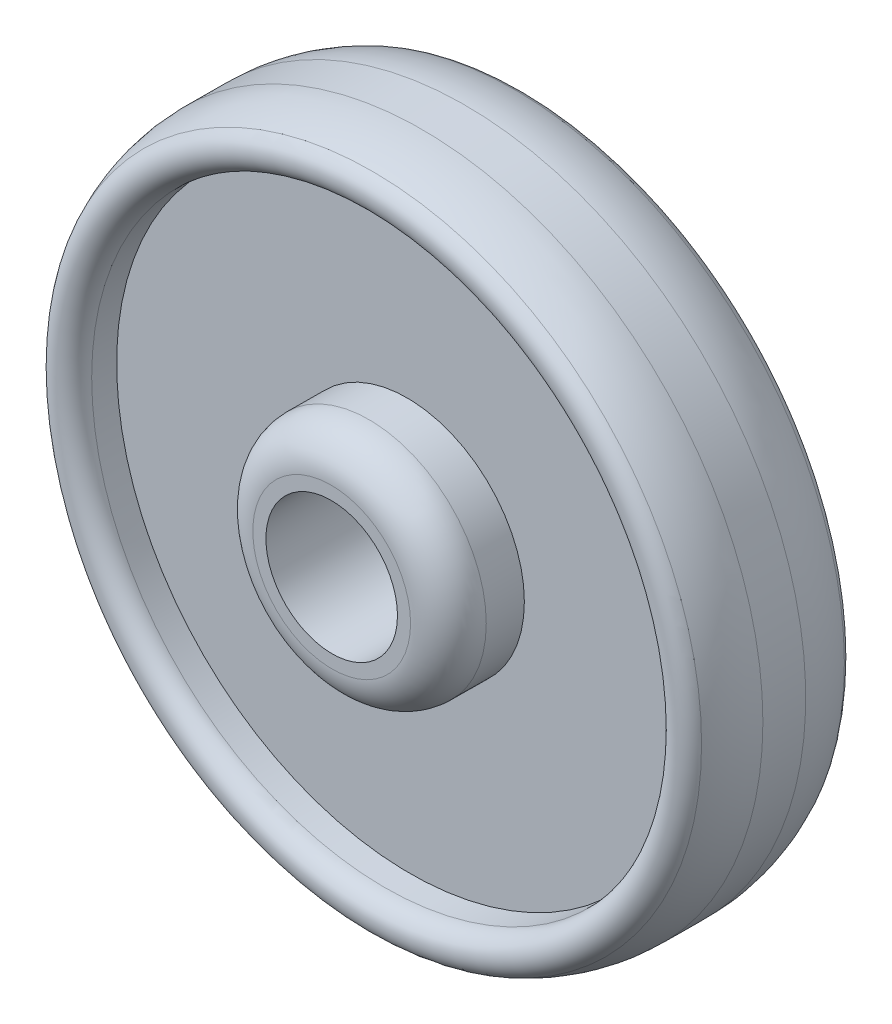
ISO-10303-21;
HEADER;
FILE_DESCRIPTION(('STEP AP214'),'2;1');
FILE_NAME('part.step','',(''),(''),'','','');
FILE_SCHEMA(('AUTOMOTIVE_DESIGN { 1 0 10303 214 1 1 1 1 }'));
ENDSEC;
DATA;
#1=APPLICATION_CONTEXT('core data for automotive mechanical design processes');
#2=APPLICATION_PROTOCOL_DEFINITION('international standard','automotive_design',2000,#1);
#3=PRODUCT_CONTEXT('',#1,'mechanical');
#4=PRODUCT('Part','Part','',(#3));
#5=PRODUCT_RELATED_PRODUCT_CATEGORY('part','',(#4));
#6=PRODUCT_DEFINITION_FORMATION('','',#4);
#7=PRODUCT_DEFINITION_CONTEXT('part definition',#1,'design');
#8=PRODUCT_DEFINITION('design','',#6,#7);
#9=PRODUCT_DEFINITION_SHAPE('','',#8);
#10=(LENGTH_UNIT() NAMED_UNIT(*) SI_UNIT(.MILLI.,.METRE.));
#11=(NAMED_UNIT(*) PLANE_ANGLE_UNIT() SI_UNIT($,.RADIAN.));
#12=(NAMED_UNIT(*) SI_UNIT($,.STERADIAN.) SOLID_ANGLE_UNIT());
#13=UNCERTAINTY_MEASURE_WITH_UNIT(LENGTH_MEASURE(1.E-05),#10,'distance_accuracy_value','');
#14=(GEOMETRIC_REPRESENTATION_CONTEXT(3) GLOBAL_UNCERTAINTY_ASSIGNED_CONTEXT((#13)) GLOBAL_UNIT_ASSIGNED_CONTEXT((#10,
#11,#12)) REPRESENTATION_CONTEXT('',''));
#15=CARTESIAN_POINT('',(0.,0.,0.));
#16=DIRECTION('',(0.,0.,1.));
#17=DIRECTION('',(1.,0.,0.));
#18=AXIS2_PLACEMENT_3D('',#15,#16,#17);
#19=CARTESIAN_POINT('',(-31.5622900748722,26.7347311363403,8.81985132786662));
#20=DIRECTION('',(-0.00675871027734653,0.,0.999977159656853));
#21=DIRECTION('',(0.999977159656853,0.,0.00675871027734653));
#22=AXIS2_PLACEMENT_3D('',#19,#20,#21);
#23=PLANE('',#22);
#24=CARTESIAN_POINT('',(-31.5622900748722,26.7347311363403,8.81985132786662));
#25=DIRECTION('',(-0.00675871027734653,0.,0.999977159656853));
#26=DIRECTION('',(0.999977159656853,0.,0.00675871027734653));
#27=AXIS2_PLACEMENT_3D('',#24,#25,#26);
#28=CIRCLE('',#27,2.09851706206891);
#29=CARTESIAN_POINT('',(-29.4638209436531,26.7347311363403,8.83403459670121));
#30=VERTEX_POINT('',#29);
#31=EDGE_CURVE('E76',#30,#30,#28,.F.);
#32=ORIENTED_EDGE('',*,*,#31,.T.);
#33=EDGE_LOOP('',(#32));
#34=FACE_BOUND('',#33,.T.);
#35=CARTESIAN_POINT('',(-31.5622900748722,26.7347311363403,8.81985132786662));
#36=DIRECTION('',(-0.00675871027734653,0.,0.999977159656853));
#37=DIRECTION('',(0.999977159656853,0.,0.00675871027734653));
#38=AXIS2_PLACEMENT_3D('',#35,#36,#37);
#39=CIRCLE('',#38,1.75);
#40=CARTESIAN_POINT('',(-29.8123300454727,26.7347311363403,8.83167907085197));
#41=VERTEX_POINT('',#40);
#42=EDGE_CURVE('E88',#41,#41,#39,.T.);
#43=ORIENTED_EDGE('',*,*,#42,.T.);
#44=EDGE_LOOP('',(#43));
#45=FACE_BOUND('',#44,.T.);
#46=ADVANCED_FACE('F38',(#34,#45),#23,.F.);
#47=CARTESIAN_POINT('',(-31.6028423365363,26.7347311363403,14.8197142858077));
#48=DIRECTION('',(-0.00675871027734653,0.,0.999977159656853));
#49=DIRECTION('',(0.999977159656853,0.,0.00675871027734653));
#50=AXIS2_PLACEMENT_3D('',#47,#48,#49);
#51=PLANE('',#50);
#52=CARTESIAN_POINT('',(-31.6028423365363,26.7347311363403,14.8197142858077));
#53=DIRECTION('',(-0.00675871027734653,0.,0.999977159656853));
#54=DIRECTION('',(0.999977159656853,0.,0.00675871027734653));
#55=AXIS2_PLACEMENT_3D('',#52,#53,#54);
#56=CIRCLE('',#55,2.09851706206892);
#57=CARTESIAN_POINT('',(-29.5043732053172,26.7347311363403,14.8338975546423));
#58=VERTEX_POINT('',#57);
#59=EDGE_CURVE('E68',#58,#58,#56,.T.);
#60=ORIENTED_EDGE('',*,*,#59,.T.);
#61=EDGE_LOOP('',(#60));
#62=FACE_BOUND('',#61,.T.);
#63=CARTESIAN_POINT('',(-31.6028423365363,26.7347311363403,14.8197142858077));
#64=DIRECTION('',(-0.00675871027734653,0.,0.999977159656853));
#65=DIRECTION('',(0.999977159656853,0.,0.00675871027734653));
#66=AXIS2_PLACEMENT_3D('',#63,#64,#65);
#67=CIRCLE('',#66,1.75);
#68=CARTESIAN_POINT('',(-29.8528823071368,26.7347311363403,14.8315420287931));
#69=VERTEX_POINT('',#68);
#70=EDGE_CURVE('E87',#69,#69,#67,.T.);
#71=ORIENTED_EDGE('',*,*,#70,.F.);
#72=EDGE_LOOP('',(#71));
#73=FACE_BOUND('',#72,.T.);
#74=ADVANCED_FACE('F131',(#62,#73),#51,.T.);
#75=CARTESIAN_POINT('',(-31.6028423365363,26.7347311363403,14.8197142858077));
#76=DIRECTION('',(0.00675871027734653,0.,-0.999977159656853));
#77=DIRECTION('',(-0.999977159656853,0.,-0.00675871027734653));
#78=AXIS2_PLACEMENT_3D('',#75,#76,#77);
#79=CYLINDRICAL_SURFACE('',#78,9.);
#80=CARTESIAN_POINT('',(-31.5863657902371,26.7347311363403,12.3819459405042));
#81=DIRECTION('',(-0.00675871027734653,0.,0.999977159656853));
#82=DIRECTION('',(0.999977159656853,0.,0.00675871027734653));
#83=AXIS2_PLACEMENT_3D('',#80,#81,#82);
#84=CIRCLE('',#83,9.);
#85=CARTESIAN_POINT('',(-22.5865713533254,26.7347311363403,12.4427743330003));
#86=VERTEX_POINT('',#85);
#87=EDGE_CURVE('E80',#86,#86,#84,.F.);
#88=ORIENTED_EDGE('',*,*,#87,.T.);
#89=EDGE_LOOP('',(#88));
#90=FACE_BOUND('',#89,.T.);
#91=CARTESIAN_POINT('',(-31.5787666211714,26.7347311363403,11.2576196731702));
#92=DIRECTION('',(0.00675871027734653,0.,-0.999977159656853));
#93=DIRECTION('',(-0.999977159656853,0.,-0.00675871027734653));
#94=AXIS2_PLACEMENT_3D('',#91,#92,#93);
#95=CIRCLE('',#94,9.);
#96=CARTESIAN_POINT('',(-40.5785610580831,26.7347311363403,11.1967912806741));
#97=VERTEX_POINT('',#96);
#98=EDGE_CURVE('E83',#97,#97,#95,.F.);
#99=ORIENTED_EDGE('',*,*,#98,.T.);
#100=EDGE_LOOP('',(#99));
#101=FACE_BOUND('',#100,.T.);
#102=ADVANCED_FACE('F137',(#90,#101),#79,.T.);
#103=CARTESIAN_POINT('',(-31.6028423365363,26.7347311363403,14.8197142858077));
#104=DIRECTION('',(0.00675871027734653,0.,-0.999977159656853));
#105=DIRECTION('',(-0.999977159656853,0.,-0.00675871027734653));
#106=AXIS2_PLACEMENT_3D('',#103,#104,#105);
#107=CYLINDRICAL_SURFACE('',#106,1.75);
#108=ORIENTED_EDGE('',*,*,#70,.T.);
#109=EDGE_LOOP('',(#108));
#110=FACE_BOUND('',#109,.T.);
#111=ORIENTED_EDGE('',*,*,#42,.F.);
#112=EDGE_LOOP('',(#111));
#113=FACE_BOUND('',#112,.T.);
#114=ADVANCED_FACE('F145',(#110,#113),#107,.F.);
#115=CARTESIAN_POINT('',(-31.5893249159816,26.7347311363403,12.819759966494));
#116=DIRECTION('',(-0.00675871027734653,0.,0.999977159656853));
#117=DIRECTION('',(0.999977159656853,0.,0.00675871027734653));
#118=AXIS2_PLACEMENT_3D('',#115,#116,#117);
#119=CYLINDRICAL_SURFACE('',#118,3.09851706206892);
#120=CARTESIAN_POINT('',(-31.5960836262589,26.7347311363403,13.8197371261509));
#121=DIRECTION('',(-0.00675871027734653,0.,0.999977159656853));
#122=DIRECTION('',(0.999977159656853,0.,0.00675871027734653));
#123=AXIS2_PLACEMENT_3D('',#120,#121,#122);
#124=CIRCLE('',#123,3.09851706206892);
#125=CARTESIAN_POINT('',(-28.497637335383,26.7347311363403,13.8406791052628));
#126=VERTEX_POINT('',#125);
#127=EDGE_CURVE('E64',#126,#126,#124,.F.);
#128=ORIENTED_EDGE('',*,*,#127,.T.);
#129=EDGE_LOOP('',(#128));
#130=FACE_BOUND('',#129,.T.);
#131=CARTESIAN_POINT('',(-31.5893249159816,26.7347311363403,12.819759966494));
#132=DIRECTION('',(-0.00675871027734652,0.,0.999977159656853));
#133=DIRECTION('',(0.999977159656853,0.,0.00675871027734652));
#134=AXIS2_PLACEMENT_3D('',#131,#132,#133);
#135=CIRCLE('',#134,3.09851706206892);
#136=CARTESIAN_POINT('',(-28.4908786251056,26.7347311363403,12.840701945606));
#137=VERTEX_POINT('',#136);
#138=EDGE_CURVE('E99',#137,#137,#135,.T.);
#139=ORIENTED_EDGE('',*,*,#138,.T.);
#140=EDGE_LOOP('',(#139));
#141=FACE_BOUND('',#140,.T.);
#142=ADVANCED_FACE('F231',(#130,#141),#119,.T.);
#143=CARTESIAN_POINT('',(-31.5893249159816,26.7347311363403,12.819759966494));
#144=DIRECTION('',(-0.00675871027734653,0.,0.999977159656853));
#145=DIRECTION('',(0.999977159656853,0.,0.00675871027734653));
#146=AXIS2_PLACEMENT_3D('',#143,#144,#145);
#147=CYLINDRICAL_SURFACE('',#146,7.7484318740111);
#148=CARTESIAN_POINT('',(-31.5937527671756,26.7347311363403,13.4748775671457));
#149=DIRECTION('',(0.00675871027734653,0.,-0.999977159656853));
#150=DIRECTION('',(-0.999977159656853,0.,-0.00675871027734653));
#151=AXIS2_PLACEMENT_3D('',#148,#149,#150);
#152=CIRCLE('',#151,7.7484318740111);
#153=CARTESIAN_POINT('',(-39.3420076643439,26.7347311363403,13.4225081610055));
#154=VERTEX_POINT('',#153);
#155=EDGE_CURVE('E46',#154,#154,#152,.F.);
#156=ORIENTED_EDGE('',*,*,#155,.T.);
#157=EDGE_LOOP('',(#156));
#158=FACE_BOUND('',#157,.T.);
#159=CARTESIAN_POINT('',(-31.5893249159816,26.7347311363403,12.819759966494));
#160=DIRECTION('',(-0.00675871027734652,0.,0.999977159656853));
#161=DIRECTION('',(0.999977159656853,0.,0.00675871027734652));
#162=AXIS2_PLACEMENT_3D('',#159,#160,#161);
#163=CIRCLE('',#162,7.7484318740111);
#164=CARTESIAN_POINT('',(-23.8410700188133,26.7347311363403,12.8721293726342));
#165=VERTEX_POINT('',#164);
#166=EDGE_CURVE('E92',#165,#165,#163,.T.);
#167=ORIENTED_EDGE('',*,*,#166,.F.);
#168=EDGE_LOOP('',(#167));
#169=FACE_BOUND('',#168,.T.);
#170=ADVANCED_FACE('F127',(#158,#169),#147,.F.);
#171=CARTESIAN_POINT('',(-0.0880860699983133,0.,13.0326725762285));
#172=DIRECTION('',(-0.00675871027734652,0.,0.999977159656853));
#173=DIRECTION('',(0.999977159656853,0.,0.00675871027734652));
#174=AXIS2_PLACEMENT_3D('',#171,#172,#173);
#175=PLANE('',#174);
#176=ORIENTED_EDGE('',*,*,#138,.F.);
#177=EDGE_LOOP('',(#176));
#178=FACE_BOUND('',#177,.T.);
#179=ORIENTED_EDGE('',*,*,#166,.T.);
#180=EDGE_LOOP('',(#179));
#181=FACE_BOUND('',#180,.T.);
#182=ADVANCED_FACE('F121',(#178,#181),#175,.T.);
#183=CARTESIAN_POINT('',(-31.5758074954269,26.7347311363403,10.8198056471803));
#184=DIRECTION('',(0.00675871027734653,0.,-0.999977159656853));
#185=DIRECTION('',(-0.999977159656853,0.,-0.00675871027734653));
#186=AXIS2_PLACEMENT_3D('',#183,#184,#185);
#187=CYLINDRICAL_SURFACE('',#186,7.74843187401109);
#188=CARTESIAN_POINT('',(-31.5713796442329,26.7347311363403,10.1646880465286));
#189=DIRECTION('',(-0.00675871027734653,0.,0.999977159656853));
#190=DIRECTION('',(0.999977159656853,0.,0.00675871027734653));
#191=AXIS2_PLACEMENT_3D('',#188,#189,#190);
#192=CIRCLE('',#191,7.74843187401109);
#193=CARTESIAN_POINT('',(-23.8231247470646,26.7347311363403,10.2170574526688));
#194=VERTEX_POINT('',#193);
#195=EDGE_CURVE('E58',#194,#194,#192,.F.);
#196=ORIENTED_EDGE('',*,*,#195,.T.);
#197=EDGE_LOOP('',(#196));
#198=FACE_BOUND('',#197,.T.);
#199=CARTESIAN_POINT('',(-31.5758074954269,26.7347311363403,10.8198056471803));
#200=DIRECTION('',(0.00675871027734653,0.,-0.999977159656853));
#201=DIRECTION('',(-0.999977159656853,0.,-0.00675871027734653));
#202=AXIS2_PLACEMENT_3D('',#199,#200,#201);
#203=CIRCLE('',#202,7.74843187401109);
#204=CARTESIAN_POINT('',(-39.3240623925951,26.7347311363403,10.7674362410401));
#205=VERTEX_POINT('',#204);
#206=EDGE_CURVE('E103',#205,#205,#203,.T.);
#207=ORIENTED_EDGE('',*,*,#206,.F.);
#208=EDGE_LOOP('',(#207));
#209=FACE_BOUND('',#208,.T.);
#210=ADVANCED_FACE('F116',(#198,#209),#187,.F.);
#211=CARTESIAN_POINT('',(-31.5758074954269,26.7347311363403,10.8198056471803));
#212=DIRECTION('',(0.00675871027734653,0.,-0.999977159656853));
#213=DIRECTION('',(-0.999977159656853,0.,-0.00675871027734653));
#214=AXIS2_PLACEMENT_3D('',#211,#212,#213);
#215=PLANE('',#214);
#216=CARTESIAN_POINT('',(-31.5758074954269,26.7347311363403,10.8198056471803));
#217=DIRECTION('',(0.00675871027734653,0.,-0.999977159656853));
#218=DIRECTION('',(-0.999977159656853,0.,-0.00675871027734653));
#219=AXIS2_PLACEMENT_3D('',#216,#217,#218);
#220=CIRCLE('',#219,3.09851706206891);
#221=CARTESIAN_POINT('',(-34.6742537863029,26.7347311363403,10.7988636680684));
#222=VERTEX_POINT('',#221);
#223=EDGE_CURVE('E107',#222,#222,#220,.T.);
#224=ORIENTED_EDGE('',*,*,#223,.F.);
#225=EDGE_LOOP('',(#224));
#226=FACE_BOUND('',#225,.T.);
#227=ORIENTED_EDGE('',*,*,#206,.T.);
#228=EDGE_LOOP('',(#227));
#229=FACE_BOUND('',#228,.T.);
#230=ADVANCED_FACE('F113',(#226,#229),#215,.T.);
#231=CARTESIAN_POINT('',(-31.5758074954269,26.7347311363403,10.8198056471803));
#232=DIRECTION('',(0.00675871027734653,0.,-0.999977159656853));
#233=DIRECTION('',(-0.999977159656853,0.,-0.00675871027734653));
#234=AXIS2_PLACEMENT_3D('',#231,#232,#233);
#235=CYLINDRICAL_SURFACE('',#234,3.09851706206891);
#236=CARTESIAN_POINT('',(-31.5690487851496,26.7347311363403,9.81982848752347));
#237=DIRECTION('',(-0.00675871027734653,0.,0.999977159656853));
#238=DIRECTION('',(0.999977159656853,0.,0.00675871027734653));
#239=AXIS2_PLACEMENT_3D('',#236,#237,#238);
#240=CIRCLE('',#239,3.09851706206891);
#241=CARTESIAN_POINT('',(-28.4706024942736,26.7347311363403,9.84077046663541));
#242=VERTEX_POINT('',#241);
#243=EDGE_CURVE('E72',#242,#242,#240,.T.);
#244=ORIENTED_EDGE('',*,*,#243,.T.);
#245=EDGE_LOOP('',(#244));
#246=FACE_BOUND('',#245,.T.);
#247=ORIENTED_EDGE('',*,*,#223,.T.);
#248=EDGE_LOOP('',(#247));
#249=FACE_BOUND('',#248,.T.);
#250=ADVANCED_FACE('F111',(#246,#249),#235,.T.);
#251=CARTESIAN_POINT('',(-31.5863657902371,26.7347311363403,12.3819459405042));
#252=DIRECTION('',(-0.00675871027734653,0.,0.999977159656853));
#253=DIRECTION('',(0.999977159656853,0.,0.00675871027734653));
#254=AXIS2_PLACEMENT_3D('',#251,#252,#253);
#255=TOROIDAL_SURFACE('',#254,6.,3.);
#256=CARTESIAN_POINT('',(-31.5952301625633,26.7347311363403,13.6934638924734));
#257=DIRECTION('',(0.00675871027734653,0.,-0.999977159656853));
#258=DIRECTION('',(-0.999977159656853,0.,-0.00675871027734653));
#259=AXIS2_PLACEMENT_3D('',#256,#257,#258);
#260=CIRCLE('',#259,8.69811824881077);
#261=CARTESIAN_POINT('',(-40.2931497433686,26.7347311363403,13.6346758312716));
#262=VERTEX_POINT('',#261);
#263=EDGE_CURVE('E10',#262,#262,#260,.T.);
#264=ORIENTED_EDGE('',*,*,#263,.T.);
#265=EDGE_LOOP('',(#264));
#266=FACE_BOUND('',#265,.T.);
#267=ORIENTED_EDGE('',*,*,#87,.F.);
#268=EDGE_LOOP('',(#267));
#269=FACE_BOUND('',#268,.T.);
#270=ADVANCED_FACE('F147',(#266,#269),#255,.T.);
#271=CARTESIAN_POINT('',(-31.5787666211714,26.7347311363403,11.2576196731702));
#272=DIRECTION('',(0.00675871027734653,0.,-0.999977159656853));
#273=DIRECTION('',(-0.999977159656853,0.,-0.00675871027734653));
#274=AXIS2_PLACEMENT_3D('',#271,#272,#273);
#275=TOROIDAL_SURFACE('',#274,6.,3.);
#276=CARTESIAN_POINT('',(-31.5699022488452,26.7347311363403,9.94610172120093));
#277=DIRECTION('',(-0.00675871027734653,0.,0.999977159656853));
#278=DIRECTION('',(0.999977159656853,0.,0.00675871027734653));
#279=AXIS2_PLACEMENT_3D('',#276,#277,#278);
#280=CIRCLE('',#279,8.69811824881076);
#281=CARTESIAN_POINT('',(-22.8719826680399,26.7347311363403,10.0048897824027));
#282=VERTEX_POINT('',#281);
#283=EDGE_CURVE('E53',#282,#282,#280,.T.);
#284=ORIENTED_EDGE('',*,*,#283,.T.);
#285=EDGE_LOOP('',(#284));
#286=FACE_BOUND('',#285,.T.);
#287=ORIENTED_EDGE('',*,*,#98,.F.);
#288=EDGE_LOOP('',(#287));
#289=FACE_BOUND('',#288,.T.);
#290=ADVANCED_FACE('F150',(#286,#289),#275,.T.);
#291=CARTESIAN_POINT('',(-31.5690487851496,26.7347311363403,9.81982848752347));
#292=DIRECTION('',(-0.00675871027734653,0.,0.999977159656853));
#293=DIRECTION('',(0.999977159656853,0.,0.00675871027734653));
#294=AXIS2_PLACEMENT_3D('',#291,#292,#293);
#295=TOROIDAL_SURFACE('',#294,2.09851706206891,1.);
#296=ORIENTED_EDGE('',*,*,#243,.F.);
#297=EDGE_LOOP('',(#296));
#298=FACE_BOUND('',#297,.T.);
#299=ORIENTED_EDGE('',*,*,#31,.F.);
#300=EDGE_LOOP('',(#299));
#301=FACE_BOUND('',#300,.T.);
#302=ADVANCED_FACE('F153',(#298,#301),#295,.T.);
#303=CARTESIAN_POINT('',(-31.5960836262589,26.7347311363403,13.8197371261509));
#304=DIRECTION('',(-0.00675871027734653,0.,0.999977159656853));
#305=DIRECTION('',(0.999977159656853,0.,0.00675871027734653));
#306=AXIS2_PLACEMENT_3D('',#303,#304,#305);
#307=TOROIDAL_SURFACE('',#306,2.09851706206892,1.);
#308=ORIENTED_EDGE('',*,*,#127,.F.);
#309=EDGE_LOOP('',(#308));
#310=FACE_BOUND('',#309,.T.);
#311=ORIENTED_EDGE('',*,*,#59,.F.);
#312=EDGE_LOOP('',(#311));
#313=FACE_BOUND('',#312,.T.);
#314=ADVANCED_FACE('F157',(#310,#313),#307,.T.);
#315=CARTESIAN_POINT('',(-31.5713796442329,26.7347311363403,10.1646880465286));
#316=DIRECTION('',(-0.00675871027734653,0.,0.999977159656853));
#317=DIRECTION('',(0.999977159656853,0.,0.00675871027734653));
#318=AXIS2_PLACEMENT_3D('',#315,#316,#317);
#319=TOROIDAL_SURFACE('',#318,8.24843187401003,0.5);
#320=ORIENTED_EDGE('',*,*,#283,.F.);
#321=EDGE_LOOP('',(#320));
#322=FACE_BOUND('',#321,.T.);
#323=ORIENTED_EDGE('',*,*,#195,.F.);
#324=EDGE_LOOP('',(#323));
#325=FACE_BOUND('',#324,.T.);
#326=ADVANCED_FACE('F160',(#322,#325),#319,.T.);
#327=CARTESIAN_POINT('',(-31.5937527671756,26.7347311363403,13.4748775671457));
#328=DIRECTION('',(0.00675871027734653,0.,-0.999977159656853));
#329=DIRECTION('',(-0.999977159656853,0.,-0.00675871027734653));
#330=AXIS2_PLACEMENT_3D('',#327,#328,#329);
#331=TOROIDAL_SURFACE('',#330,8.24843187401003,0.5);
#332=ORIENTED_EDGE('',*,*,#263,.F.);
#333=EDGE_LOOP('',(#332));
#334=FACE_BOUND('',#333,.T.);
#335=ORIENTED_EDGE('',*,*,#155,.F.);
#336=EDGE_LOOP('',(#335));
#337=FACE_BOUND('',#336,.T.);
#338=ADVANCED_FACE('F40',(#334,#337),#331,.T.);
#339=CLOSED_SHELL('',(#46,#74,#102,#114,#142,#170,#182,#210,#230,#250,#270,#290,#302,#314,#326,#338));
#340=MANIFOLD_SOLID_BREP('B2',#339);
#341=ADVANCED_BREP_SHAPE_REPRESENTATION('',(#18,#340),#14);
#342=SHAPE_DEFINITION_REPRESENTATION(#9,#341);
ENDSEC;
END-ISO-10303-21;
